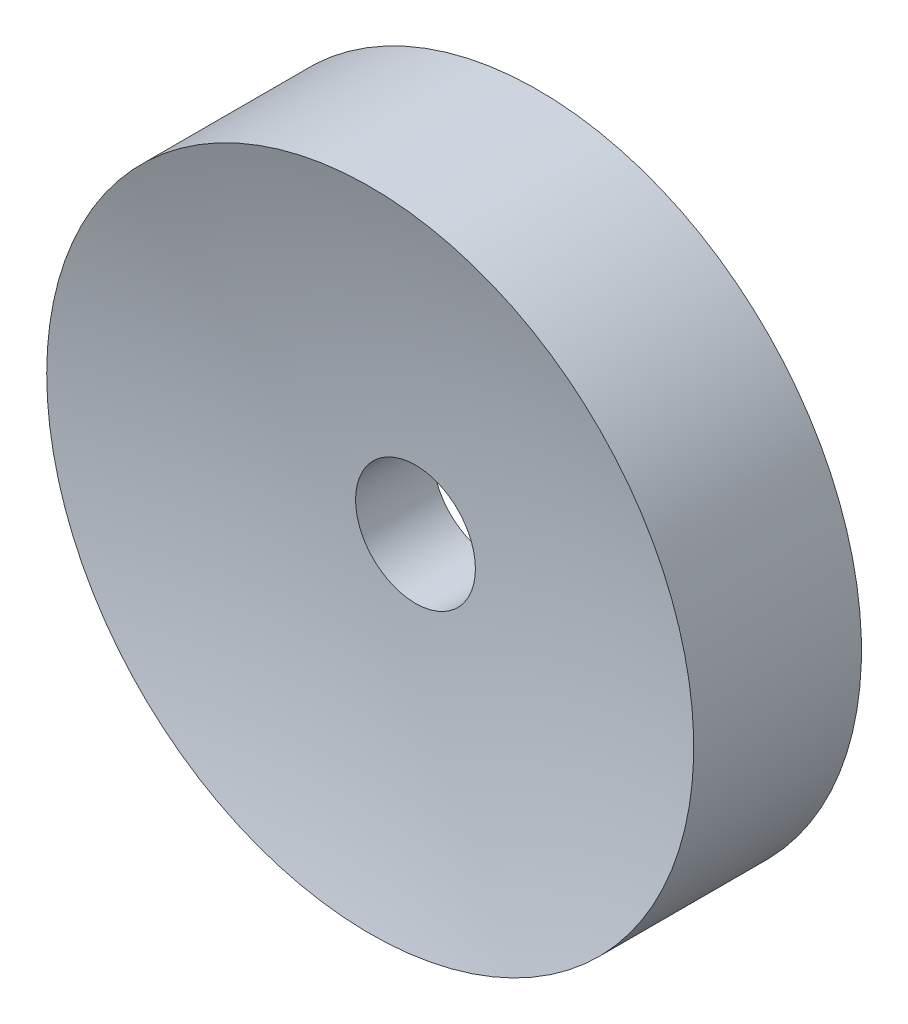
ISO-10303-21;
HEADER;
FILE_DESCRIPTION(('STEP AP214'),'2;1');
FILE_NAME('part.step','',(''),(''),'','','');
FILE_SCHEMA(('AUTOMOTIVE_DESIGN { 1 0 10303 214 1 1 1 1 }'));
ENDSEC;
DATA;
#1=APPLICATION_CONTEXT('core data for automotive mechanical design processes');
#2=APPLICATION_PROTOCOL_DEFINITION('international standard','automotive_design',2000,#1);
#3=PRODUCT_CONTEXT('',#1,'mechanical');
#4=PRODUCT('Part','Part','',(#3));
#5=PRODUCT_RELATED_PRODUCT_CATEGORY('part','',(#4));
#6=PRODUCT_DEFINITION_FORMATION('','',#4);
#7=PRODUCT_DEFINITION_CONTEXT('part definition',#1,'design');
#8=PRODUCT_DEFINITION('design','',#6,#7);
#9=PRODUCT_DEFINITION_SHAPE('','',#8);
#10=(LENGTH_UNIT() NAMED_UNIT(*) SI_UNIT(.MILLI.,.METRE.));
#11=(NAMED_UNIT(*) PLANE_ANGLE_UNIT() SI_UNIT($,.RADIAN.));
#12=(NAMED_UNIT(*) SI_UNIT($,.STERADIAN.) SOLID_ANGLE_UNIT());
#13=UNCERTAINTY_MEASURE_WITH_UNIT(LENGTH_MEASURE(1.E-05),#10,'distance_accuracy_value','');
#14=(GEOMETRIC_REPRESENTATION_CONTEXT(3) GLOBAL_UNCERTAINTY_ASSIGNED_CONTEXT((#13)) GLOBAL_UNIT_ASSIGNED_CONTEXT((#10,
#11,#12)) REPRESENTATION_CONTEXT('',''));
#15=CARTESIAN_POINT('',(0.,0.,0.));
#16=DIRECTION('',(0.,0.,1.));
#17=DIRECTION('',(1.,0.,0.));
#18=AXIS2_PLACEMENT_3D('',#15,#16,#17);
#19=CARTESIAN_POINT('',(0.,0.,1.75));
#20=DIRECTION('',(0.,0.,-1.));
#21=DIRECTION('',(-1.,0.,0.));
#22=AXIS2_PLACEMENT_3D('',#19,#20,#21);
#23=CYLINDRICAL_SURFACE('',#22,1.25);
#24=CARTESIAN_POINT('',(0.,0.,-0.805717716336935));
#25=DIRECTION('',(0.,0.,-1.));
#26=DIRECTION('',(-1.,0.,0.));
#27=AXIS2_PLACEMENT_3D('',#24,#25,#26);
#28=CIRCLE('',#27,1.25);
#29=CARTESIAN_POINT('',(-1.25,0.,-0.805717716336935));
#30=VERTEX_POINT('',#29);
#31=EDGE_CURVE('E10',#30,#30,#28,.T.);
#32=ORIENTED_EDGE('',*,*,#31,.T.);
#33=EDGE_LOOP('',(#32));
#34=FACE_BOUND('',#33,.T.);
#35=CARTESIAN_POINT('',(0.,0.,0.805717716336935));
#36=DIRECTION('',(0.,0.,1.));
#37=DIRECTION('',(1.,0.,0.));
#38=AXIS2_PLACEMENT_3D('',#35,#36,#37);
#39=CIRCLE('',#38,1.25);
#40=CARTESIAN_POINT('',(1.25,0.,0.805717716336935));
#41=VERTEX_POINT('',#40);
#42=EDGE_CURVE('E44',#41,#41,#39,.T.);
#43=ORIENTED_EDGE('',*,*,#42,.T.);
#44=EDGE_LOOP('',(#43));
#45=FACE_BOUND('',#44,.T.);
#46=ADVANCED_FACE('F33',(#34,#45),#23,.F.);
#47=CARTESIAN_POINT('',(0.,0.,1.75));
#48=DIRECTION('',(0.,0.,-1.));
#49=DIRECTION('',(-1.,0.,0.));
#50=AXIS2_PLACEMENT_3D('',#47,#48,#49);
#51=CYLINDRICAL_SURFACE('',#50,6.75);
#52=CARTESIAN_POINT('',(0.,0.,1.75));
#53=DIRECTION('',(0.,0.,-1.));
#54=DIRECTION('',(-1.,0.,0.));
#55=AXIS2_PLACEMENT_3D('',#52,#53,#54);
#56=CIRCLE('',#55,6.75);
#57=CARTESIAN_POINT('',(-6.75,0.,1.75));
#58=VERTEX_POINT('',#57);
#59=EDGE_CURVE('E48',#58,#58,#56,.T.);
#60=ORIENTED_EDGE('',*,*,#59,.T.);
#61=EDGE_LOOP('',(#60));
#62=FACE_BOUND('',#61,.T.);
#63=CARTESIAN_POINT('',(0.,0.,-1.75));
#64=DIRECTION('',(0.,0.,-1.));
#65=DIRECTION('',(-1.,0.,0.));
#66=AXIS2_PLACEMENT_3D('',#63,#64,#65);
#67=CIRCLE('',#66,6.75);
#68=CARTESIAN_POINT('',(-6.75,0.,-1.75));
#69=VERTEX_POINT('',#68);
#70=EDGE_CURVE('E40',#69,#69,#67,.T.);
#71=ORIENTED_EDGE('',*,*,#70,.F.);
#72=EDGE_LOOP('',(#71));
#73=FACE_BOUND('',#72,.T.);
#74=ADVANCED_FACE('F35',(#62,#73),#51,.T.);
#75=CARTESIAN_POINT('',(0.,0.,-24.575976783941));
#76=DIRECTION('',(0.,0.,-1.));
#77=DIRECTION('',(1.,0.,0.));
#78=AXIS2_PLACEMENT_3D('',#75,#76,#77);
#79=SPHERICAL_SURFACE('',#78,23.8031030779815);
#80=ORIENTED_EDGE('',*,*,#31,.F.);
#81=EDGE_LOOP('',(#80));
#82=FACE_BOUND('',#81,.T.);
#83=ORIENTED_EDGE('',*,*,#70,.T.);
#84=EDGE_LOOP('',(#83));
#85=FACE_BOUND('',#84,.T.);
#86=ADVANCED_FACE('F58',(#82,#85),#79,.F.);
#87=CARTESIAN_POINT('',(0.,0.,24.575976783941));
#88=DIRECTION('',(0.,0.,1.));
#89=DIRECTION('',(1.,0.,0.));
#90=AXIS2_PLACEMENT_3D('',#87,#88,#89);
#91=SPHERICAL_SURFACE('',#90,23.8031030779815);
#92=ORIENTED_EDGE('',*,*,#42,.F.);
#93=EDGE_LOOP('',(#92));
#94=FACE_BOUND('',#93,.T.);
#95=ORIENTED_EDGE('',*,*,#59,.F.);
#96=EDGE_LOOP('',(#95));
#97=FACE_BOUND('',#96,.T.);
#98=ADVANCED_FACE('F56',(#94,#97),#91,.F.);
#99=CLOSED_SHELL('',(#46,#74,#86,#98));
#100=MANIFOLD_SOLID_BREP('B2',#99);
#101=ADVANCED_BREP_SHAPE_REPRESENTATION('',(#18,#100),#14);
#102=SHAPE_DEFINITION_REPRESENTATION(#9,#101);
ENDSEC;
END-ISO-10303-21;
